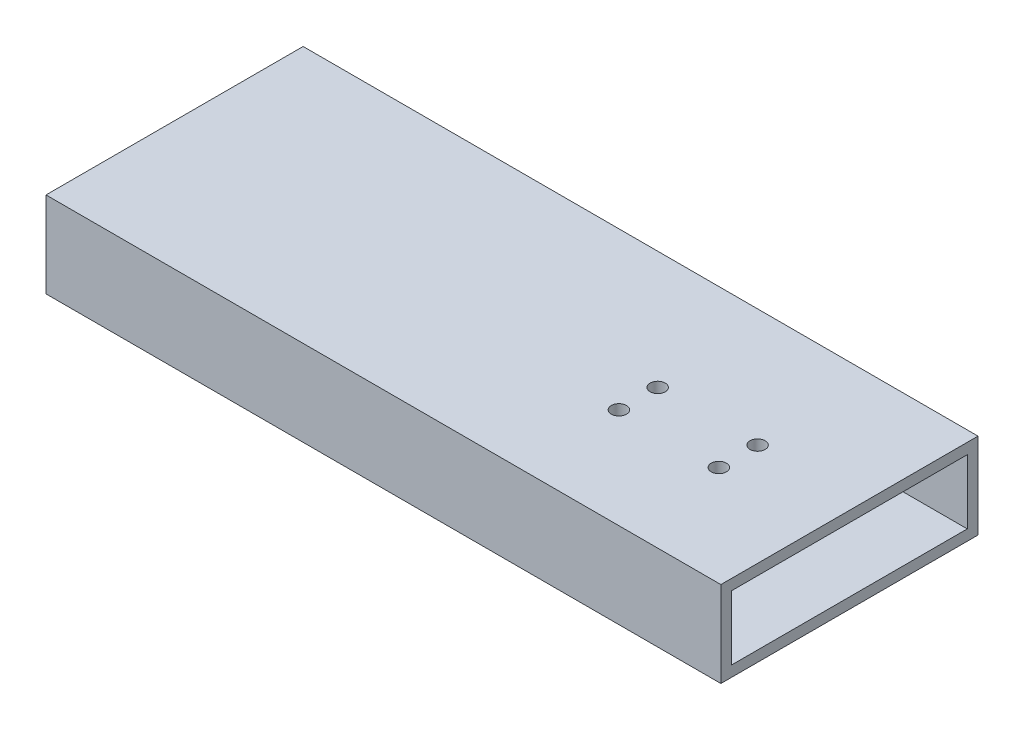
ISO-10303-21;
HEADER;
FILE_DESCRIPTION(('STEP AP214'),'2;1');
FILE_NAME('part.step','',(''),(''),'','','');
FILE_SCHEMA(('AUTOMOTIVE_DESIGN { 1 0 10303 214 1 1 1 1 }'));
ENDSEC;
DATA;
#1=APPLICATION_CONTEXT('core data for automotive mechanical design processes');
#2=APPLICATION_PROTOCOL_DEFINITION('international standard','automotive_design',2000,#1);
#3=PRODUCT_CONTEXT('',#1,'mechanical');
#4=PRODUCT('Part','Part','',(#3));
#5=PRODUCT_RELATED_PRODUCT_CATEGORY('part','',(#4));
#6=PRODUCT_DEFINITION_FORMATION('','',#4);
#7=PRODUCT_DEFINITION_CONTEXT('part definition',#1,'design');
#8=PRODUCT_DEFINITION('design','',#6,#7);
#9=PRODUCT_DEFINITION_SHAPE('','',#8);
#10=(LENGTH_UNIT() NAMED_UNIT(*) SI_UNIT(.MILLI.,.METRE.));
#11=(NAMED_UNIT(*) PLANE_ANGLE_UNIT() SI_UNIT($,.RADIAN.));
#12=(NAMED_UNIT(*) SI_UNIT($,.STERADIAN.) SOLID_ANGLE_UNIT());
#13=UNCERTAINTY_MEASURE_WITH_UNIT(LENGTH_MEASURE(1.E-05),#10,'distance_accuracy_value','');
#14=(GEOMETRIC_REPRESENTATION_CONTEXT(3) GLOBAL_UNCERTAINTY_ASSIGNED_CONTEXT((#13)) GLOBAL_UNIT_ASSIGNED_CONTEXT((#10,
#11,#12)) REPRESENTATION_CONTEXT('',''));
#15=CARTESIAN_POINT('',(0.,0.,0.));
#16=DIRECTION('',(0.,0.,1.));
#17=DIRECTION('',(1.,0.,0.));
#18=AXIS2_PLACEMENT_3D('',#15,#16,#17);
#19=CARTESIAN_POINT('',(400.,0.,0.));
#20=DIRECTION('',(-1.,0.,0.));
#21=DIRECTION('',(0.,0.,1.));
#22=AXIS2_PLACEMENT_3D('',#19,#20,#21);
#23=PLANE('',#22);
#24=DIRECTION('',(0.,1.,0.));
#25=VECTOR('',#24,1.);
#26=CARTESIAN_POINT('',(400.,-25.4,-76.2));
#27=LINE('',#26,#25);
#28=CARTESIAN_POINT('',(400.,-25.4,-76.2));
#29=VERTEX_POINT('',#28);
#30=CARTESIAN_POINT('',(400.,25.4,-76.2));
#31=VERTEX_POINT('',#30);
#32=EDGE_CURVE('E138',#29,#31,#27,.T.);
#33=ORIENTED_EDGE('',*,*,#32,.T.);
#34=DIRECTION('',(0.,0.,1.));
#35=VECTOR('',#34,1.);
#36=CARTESIAN_POINT('',(400.,25.4,76.2));
#37=LINE('',#36,#35);
#38=CARTESIAN_POINT('',(400.,25.4,76.2));
#39=VERTEX_POINT('',#38);
#40=EDGE_CURVE('E141',#31,#39,#37,.T.);
#41=ORIENTED_EDGE('',*,*,#40,.T.);
#42=DIRECTION('',(0.,-1.,0.));
#43=VECTOR('',#42,1.);
#44=CARTESIAN_POINT('',(400.,-25.4,76.2));
#45=LINE('',#44,#43);
#46=CARTESIAN_POINT('',(400.,-25.4,76.2));
#47=VERTEX_POINT('',#46);
#48=EDGE_CURVE('E144',#39,#47,#45,.T.);
#49=ORIENTED_EDGE('',*,*,#48,.T.);
#50=DIRECTION('',(0.,0.,-1.));
#51=VECTOR('',#50,1.);
#52=CARTESIAN_POINT('',(400.,-25.4,76.2));
#53=LINE('',#52,#51);
#54=EDGE_CURVE('E146',#47,#29,#53,.T.);
#55=ORIENTED_EDGE('',*,*,#54,.T.);
#56=EDGE_LOOP('',(#33,#41,#49,#55));
#57=FACE_BOUND('',#56,.T.);
#58=DIRECTION('',(0.,1.,0.));
#59=VECTOR('',#58,1.);
#60=CARTESIAN_POINT('',(400.,-19.05,-69.85));
#61=LINE('',#60,#59);
#62=CARTESIAN_POINT('',(400.,-19.05,-69.85));
#63=VERTEX_POINT('',#62);
#64=CARTESIAN_POINT('',(400.,19.05,-69.85));
#65=VERTEX_POINT('',#64);
#66=EDGE_CURVE('E100',#63,#65,#61,.T.);
#67=ORIENTED_EDGE('',*,*,#66,.F.);
#68=DIRECTION('',(0.,0.,-1.));
#69=VECTOR('',#68,1.);
#70=CARTESIAN_POINT('',(400.,-19.05,69.85));
#71=LINE('',#70,#69);
#72=CARTESIAN_POINT('',(400.,-19.05,69.85));
#73=VERTEX_POINT('',#72);
#74=EDGE_CURVE('E122',#73,#63,#71,.T.);
#75=ORIENTED_EDGE('',*,*,#74,.F.);
#76=DIRECTION('',(0.,-1.,0.));
#77=VECTOR('',#76,1.);
#78=CARTESIAN_POINT('',(400.,-19.05,69.85));
#79=LINE('',#78,#77);
#80=CARTESIAN_POINT('',(400.,19.05,69.85));
#81=VERTEX_POINT('',#80);
#82=EDGE_CURVE('E120',#81,#73,#79,.T.);
#83=ORIENTED_EDGE('',*,*,#82,.F.);
#84=DIRECTION('',(0.,0.,1.));
#85=VECTOR('',#84,1.);
#86=CARTESIAN_POINT('',(400.,19.05,69.85));
#87=LINE('',#86,#85);
#88=EDGE_CURVE('E108',#65,#81,#87,.T.);
#89=ORIENTED_EDGE('',*,*,#88,.F.);
#90=EDGE_LOOP('',(#67,#75,#83,#89));
#91=FACE_BOUND('',#90,.T.);
#92=ADVANCED_FACE('F33',(#57,#91),#23,.F.);
#93=CARTESIAN_POINT('',(0.,0.,0.));
#94=DIRECTION('',(-1.,0.,0.));
#95=DIRECTION('',(0.,0.,1.));
#96=AXIS2_PLACEMENT_3D('',#93,#94,#95);
#97=PLANE('',#96);
#98=DIRECTION('',(0.,1.,0.));
#99=VECTOR('',#98,1.);
#100=CARTESIAN_POINT('',(0.,-25.4,-76.2));
#101=LINE('',#100,#99);
#102=CARTESIAN_POINT('',(0.,-25.4,-76.2));
#103=VERTEX_POINT('',#102);
#104=CARTESIAN_POINT('',(0.,25.4,-76.2));
#105=VERTEX_POINT('',#104);
#106=EDGE_CURVE('E116',#103,#105,#101,.T.);
#107=ORIENTED_EDGE('',*,*,#106,.F.);
#108=DIRECTION('',(0.,0.,-1.));
#109=VECTOR('',#108,1.);
#110=CARTESIAN_POINT('',(0.,-25.4,76.2));
#111=LINE('',#110,#109);
#112=CARTESIAN_POINT('',(0.,-25.4,76.2));
#113=VERTEX_POINT('',#112);
#114=EDGE_CURVE('E142',#113,#103,#111,.T.);
#115=ORIENTED_EDGE('',*,*,#114,.F.);
#116=DIRECTION('',(0.,-1.,0.));
#117=VECTOR('',#116,1.);
#118=CARTESIAN_POINT('',(0.,-25.4,76.2));
#119=LINE('',#118,#117);
#120=CARTESIAN_POINT('',(0.,25.4,76.2));
#121=VERTEX_POINT('',#120);
#122=EDGE_CURVE('E153',#121,#113,#119,.T.);
#123=ORIENTED_EDGE('',*,*,#122,.F.);
#124=DIRECTION('',(0.,0.,1.));
#125=VECTOR('',#124,1.);
#126=CARTESIAN_POINT('',(0.,25.4,76.2));
#127=LINE('',#126,#125);
#128=EDGE_CURVE('E151',#105,#121,#127,.T.);
#129=ORIENTED_EDGE('',*,*,#128,.F.);
#130=EDGE_LOOP('',(#107,#115,#123,#129));
#131=FACE_BOUND('',#130,.T.);
#132=DIRECTION('',(0.,0.,-1.));
#133=VECTOR('',#132,1.);
#134=CARTESIAN_POINT('',(0.,-19.05,69.85));
#135=LINE('',#134,#133);
#136=CARTESIAN_POINT('',(0.,-19.05,69.85));
#137=VERTEX_POINT('',#136);
#138=CARTESIAN_POINT('',(0.,-19.05,-69.85));
#139=VERTEX_POINT('',#138);
#140=EDGE_CURVE('E109',#137,#139,#135,.T.);
#141=ORIENTED_EDGE('',*,*,#140,.T.);
#142=DIRECTION('',(0.,1.,0.));
#143=VECTOR('',#142,1.);
#144=CARTESIAN_POINT('',(0.,-19.05,-69.85));
#145=LINE('',#144,#143);
#146=CARTESIAN_POINT('',(0.,19.05,-69.85));
#147=VERTEX_POINT('',#146);
#148=EDGE_CURVE('E58',#139,#147,#145,.T.);
#149=ORIENTED_EDGE('',*,*,#148,.T.);
#150=DIRECTION('',(0.,0.,1.));
#151=VECTOR('',#150,1.);
#152=CARTESIAN_POINT('',(0.,19.05,69.85));
#153=LINE('',#152,#151);
#154=CARTESIAN_POINT('',(0.,19.05,69.85));
#155=VERTEX_POINT('',#154);
#156=EDGE_CURVE('E115',#147,#155,#153,.T.);
#157=ORIENTED_EDGE('',*,*,#156,.T.);
#158=DIRECTION('',(0.,-1.,0.));
#159=VECTOR('',#158,1.);
#160=CARTESIAN_POINT('',(0.,-19.05,69.85));
#161=LINE('',#160,#159);
#162=EDGE_CURVE('E130',#155,#137,#161,.T.);
#163=ORIENTED_EDGE('',*,*,#162,.T.);
#164=EDGE_LOOP('',(#141,#149,#157,#163));
#165=FACE_BOUND('',#164,.T.);
#166=ADVANCED_FACE('F222',(#131,#165),#97,.T.);
#167=CARTESIAN_POINT('',(400.,-25.4,-76.2));
#168=DIRECTION('',(0.,0.,1.));
#169=DIRECTION('',(1.,0.,0.));
#170=AXIS2_PLACEMENT_3D('',#167,#168,#169);
#171=PLANE('',#170);
#172=ORIENTED_EDGE('',*,*,#106,.T.);
#173=DIRECTION('',(-1.,0.,0.));
#174=VECTOR('',#173,1.);
#175=CARTESIAN_POINT('',(400.,25.4,-76.2));
#176=LINE('',#175,#174);
#177=EDGE_CURVE('E11',#31,#105,#176,.T.);
#178=ORIENTED_EDGE('',*,*,#177,.F.);
#179=ORIENTED_EDGE('',*,*,#32,.F.);
#180=DIRECTION('',(-1.,0.,0.));
#181=VECTOR('',#180,1.);
#182=CARTESIAN_POINT('',(400.,-25.4,-76.2));
#183=LINE('',#182,#181);
#184=EDGE_CURVE('E148',#29,#103,#183,.T.);
#185=ORIENTED_EDGE('',*,*,#184,.T.);
#186=EDGE_LOOP('',(#172,#178,#179,#185));
#187=FACE_BOUND('',#186,.T.);
#188=ADVANCED_FACE('F35',(#187),#171,.F.);
#189=CARTESIAN_POINT('',(400.,25.4,76.2));
#190=DIRECTION('',(0.,-1.,0.));
#191=DIRECTION('',(0.,0.,-1.));
#192=AXIS2_PLACEMENT_3D('',#189,#190,#191);
#193=PLANE('',#192);
#194=CARTESIAN_POINT('',(280.090000000005,25.4,16.7300000000007));
#195=DIRECTION('',(0.,-1.,0.));
#196=DIRECTION('',(0.,0.,-1.));
#197=AXIS2_PLACEMENT_3D('',#194,#195,#196);
#198=CIRCLE('',#197,4.5);
#199=CARTESIAN_POINT('',(280.090000000005,25.4,12.2300000000007));
#200=VERTEX_POINT('',#199);
#201=EDGE_CURVE('E246',#200,#200,#198,.T.);
#202=ORIENTED_EDGE('',*,*,#201,.T.);
#203=EDGE_LOOP('',(#202));
#204=FACE_BOUND('',#203,.T.);
#205=CARTESIAN_POINT('',(280.090000000005,25.4,-6.26999999999863));
#206=DIRECTION('',(0.,-1.,0.));
#207=DIRECTION('',(0.,0.,-1.));
#208=AXIS2_PLACEMENT_3D('',#205,#206,#207);
#209=CIRCLE('',#208,4.5);
#210=CARTESIAN_POINT('',(280.090000000005,25.4,-10.7699999999986));
#211=VERTEX_POINT('',#210);
#212=EDGE_CURVE('E174',#211,#211,#209,.T.);
#213=ORIENTED_EDGE('',*,*,#212,.T.);
#214=EDGE_LOOP('',(#213));
#215=FACE_BOUND('',#214,.T.);
#216=CARTESIAN_POINT('',(339.289999999982,25.4,-6.26999999999863));
#217=DIRECTION('',(0.,-1.,0.));
#218=DIRECTION('',(0.,0.,-1.));
#219=AXIS2_PLACEMENT_3D('',#216,#217,#218);
#220=CIRCLE('',#219,4.5);
#221=CARTESIAN_POINT('',(339.289999999982,25.4,-10.7699999999986));
#222=VERTEX_POINT('',#221);
#223=EDGE_CURVE('E170',#222,#222,#220,.T.);
#224=ORIENTED_EDGE('',*,*,#223,.T.);
#225=EDGE_LOOP('',(#224));
#226=FACE_BOUND('',#225,.T.);
#227=CARTESIAN_POINT('',(339.289999999982,25.4,16.7300000000007));
#228=DIRECTION('',(0.,-1.,0.));
#229=DIRECTION('',(0.,0.,-1.));
#230=AXIS2_PLACEMENT_3D('',#227,#228,#229);
#231=CIRCLE('',#230,4.5);
#232=CARTESIAN_POINT('',(339.289999999982,25.4,12.2300000000007));
#233=VERTEX_POINT('',#232);
#234=EDGE_CURVE('E166',#233,#233,#231,.T.);
#235=ORIENTED_EDGE('',*,*,#234,.T.);
#236=EDGE_LOOP('',(#235));
#237=FACE_BOUND('',#236,.T.);
#238=ORIENTED_EDGE('',*,*,#128,.T.);
#239=DIRECTION('',(-1.,0.,0.));
#240=VECTOR('',#239,1.);
#241=CARTESIAN_POINT('',(400.,25.4,76.2));
#242=LINE('',#241,#240);
#243=EDGE_CURVE('E42',#39,#121,#242,.T.);
#244=ORIENTED_EDGE('',*,*,#243,.F.);
#245=ORIENTED_EDGE('',*,*,#40,.F.);
#246=ORIENTED_EDGE('',*,*,#177,.T.);
#247=EDGE_LOOP('',(#238,#244,#245,#246));
#248=FACE_BOUND('',#247,.T.);
#249=ADVANCED_FACE('F236',(#204,#215,#226,#237,#248),#193,.F.);
#250=CARTESIAN_POINT('',(400.,-25.4,76.2));
#251=DIRECTION('',(0.,0.,-1.));
#252=DIRECTION('',(-1.,0.,0.));
#253=AXIS2_PLACEMENT_3D('',#250,#251,#252);
#254=PLANE('',#253);
#255=ORIENTED_EDGE('',*,*,#122,.T.);
#256=DIRECTION('',(-1.,0.,0.));
#257=VECTOR('',#256,1.);
#258=CARTESIAN_POINT('',(400.,-25.4,76.2));
#259=LINE('',#258,#257);
#260=EDGE_CURVE('E158',#47,#113,#259,.T.);
#261=ORIENTED_EDGE('',*,*,#260,.F.);
#262=ORIENTED_EDGE('',*,*,#48,.F.);
#263=ORIENTED_EDGE('',*,*,#243,.T.);
#264=EDGE_LOOP('',(#255,#261,#262,#263));
#265=FACE_BOUND('',#264,.T.);
#266=ADVANCED_FACE('F233',(#265),#254,.F.);
#267=CARTESIAN_POINT('',(400.,-25.4,76.2));
#268=DIRECTION('',(0.,1.,0.));
#269=DIRECTION('',(0.,0.,1.));
#270=AXIS2_PLACEMENT_3D('',#267,#268,#269);
#271=PLANE('',#270);
#272=CARTESIAN_POINT('',(280.090000000005,-25.4,16.7300000000007));
#273=DIRECTION('',(0.,-1.,0.));
#274=DIRECTION('',(0.,0.,-1.));
#275=AXIS2_PLACEMENT_3D('',#272,#273,#274);
#276=CIRCLE('',#275,4.5);
#277=CARTESIAN_POINT('',(280.090000000005,-25.4,12.2300000000007));
#278=VERTEX_POINT('',#277);
#279=EDGE_CURVE('E300',#278,#278,#276,.T.);
#280=ORIENTED_EDGE('',*,*,#279,.F.);
#281=EDGE_LOOP('',(#280));
#282=FACE_BOUND('',#281,.T.);
#283=CARTESIAN_POINT('',(280.090000000005,-25.4,-6.26999999999863));
#284=DIRECTION('',(0.,-1.,0.));
#285=DIRECTION('',(0.,0.,-1.));
#286=AXIS2_PLACEMENT_3D('',#283,#284,#285);
#287=CIRCLE('',#286,4.5);
#288=CARTESIAN_POINT('',(280.090000000005,-25.4,-10.7699999999986));
#289=VERTEX_POINT('',#288);
#290=EDGE_CURVE('E181',#289,#289,#287,.T.);
#291=ORIENTED_EDGE('',*,*,#290,.F.);
#292=EDGE_LOOP('',(#291));
#293=FACE_BOUND('',#292,.T.);
#294=CARTESIAN_POINT('',(339.289999999982,-25.4,-6.26999999999863));
#295=DIRECTION('',(0.,-1.,0.));
#296=DIRECTION('',(0.,0.,-1.));
#297=AXIS2_PLACEMENT_3D('',#294,#295,#296);
#298=CIRCLE('',#297,4.5);
#299=CARTESIAN_POINT('',(339.289999999982,-25.4,-10.7699999999986));
#300=VERTEX_POINT('',#299);
#301=EDGE_CURVE('E178',#300,#300,#298,.T.);
#302=ORIENTED_EDGE('',*,*,#301,.F.);
#303=EDGE_LOOP('',(#302));
#304=FACE_BOUND('',#303,.T.);
#305=CARTESIAN_POINT('',(339.289999999982,-25.4,16.7300000000007));
#306=DIRECTION('',(0.,-1.,0.));
#307=DIRECTION('',(0.,0.,-1.));
#308=AXIS2_PLACEMENT_3D('',#305,#306,#307);
#309=CIRCLE('',#308,4.5);
#310=CARTESIAN_POINT('',(339.289999999982,-25.4,12.2300000000007));
#311=VERTEX_POINT('',#310);
#312=EDGE_CURVE('E196',#311,#311,#309,.T.);
#313=ORIENTED_EDGE('',*,*,#312,.F.);
#314=EDGE_LOOP('',(#313));
#315=FACE_BOUND('',#314,.T.);
#316=ORIENTED_EDGE('',*,*,#114,.T.);
#317=ORIENTED_EDGE('',*,*,#184,.F.);
#318=ORIENTED_EDGE('',*,*,#54,.F.);
#319=ORIENTED_EDGE('',*,*,#260,.T.);
#320=EDGE_LOOP('',(#316,#317,#318,#319));
#321=FACE_BOUND('',#320,.T.);
#322=ADVANCED_FACE('F217',(#282,#293,#304,#315,#321),#271,.F.);
#323=CARTESIAN_POINT('',(400.,-19.05,-69.85));
#324=DIRECTION('',(0.,0.,1.));
#325=DIRECTION('',(1.,0.,0.));
#326=AXIS2_PLACEMENT_3D('',#323,#324,#325);
#327=PLANE('',#326);
#328=ORIENTED_EDGE('',*,*,#148,.F.);
#329=DIRECTION('',(-1.,0.,0.));
#330=VECTOR('',#329,1.);
#331=CARTESIAN_POINT('',(400.,-19.05,-69.85));
#332=LINE('',#331,#330);
#333=EDGE_CURVE('E104',#63,#139,#332,.T.);
#334=ORIENTED_EDGE('',*,*,#333,.F.);
#335=ORIENTED_EDGE('',*,*,#66,.T.);
#336=DIRECTION('',(-1.,0.,0.));
#337=VECTOR('',#336,1.);
#338=CARTESIAN_POINT('',(400.,19.05,-69.85));
#339=LINE('',#338,#337);
#340=EDGE_CURVE('E103',#65,#147,#339,.T.);
#341=ORIENTED_EDGE('',*,*,#340,.T.);
#342=EDGE_LOOP('',(#328,#334,#335,#341));
#343=FACE_BOUND('',#342,.T.);
#344=ADVANCED_FACE('F102',(#343),#327,.T.);
#345=CARTESIAN_POINT('',(400.,19.05,69.85));
#346=DIRECTION('',(0.,-1.,0.));
#347=DIRECTION('',(0.,0.,-1.));
#348=AXIS2_PLACEMENT_3D('',#345,#346,#347);
#349=PLANE('',#348);
#350=CARTESIAN_POINT('',(280.090000000005,19.05,16.7300000000007));
#351=DIRECTION('',(0.,-1.,0.));
#352=DIRECTION('',(0.,0.,-1.));
#353=AXIS2_PLACEMENT_3D('',#350,#351,#352);
#354=CIRCLE('',#353,4.5);
#355=CARTESIAN_POINT('',(280.090000000005,19.05,12.2300000000007));
#356=VERTEX_POINT('',#355);
#357=EDGE_CURVE('E186',#356,#356,#354,.T.);
#358=ORIENTED_EDGE('',*,*,#357,.F.);
#359=EDGE_LOOP('',(#358));
#360=FACE_BOUND('',#359,.T.);
#361=CARTESIAN_POINT('',(280.090000000005,19.05,-6.26999999999863));
#362=DIRECTION('',(0.,-1.,0.));
#363=DIRECTION('',(0.,0.,-1.));
#364=AXIS2_PLACEMENT_3D('',#361,#362,#363);
#365=CIRCLE('',#364,4.5);
#366=CARTESIAN_POINT('',(280.090000000005,19.05,-10.7699999999986));
#367=VERTEX_POINT('',#366);
#368=EDGE_CURVE('E173',#367,#367,#365,.T.);
#369=ORIENTED_EDGE('',*,*,#368,.F.);
#370=EDGE_LOOP('',(#369));
#371=FACE_BOUND('',#370,.T.);
#372=CARTESIAN_POINT('',(339.289999999982,19.05,-6.26999999999863));
#373=DIRECTION('',(0.,-1.,0.));
#374=DIRECTION('',(0.,0.,-1.));
#375=AXIS2_PLACEMENT_3D('',#372,#373,#374);
#376=CIRCLE('',#375,4.5);
#377=CARTESIAN_POINT('',(339.289999999982,19.05,-10.7699999999986));
#378=VERTEX_POINT('',#377);
#379=EDGE_CURVE('E169',#378,#378,#376,.T.);
#380=ORIENTED_EDGE('',*,*,#379,.F.);
#381=EDGE_LOOP('',(#380));
#382=FACE_BOUND('',#381,.T.);
#383=CARTESIAN_POINT('',(339.289999999982,19.05,16.7300000000007));
#384=DIRECTION('',(0.,-1.,0.));
#385=DIRECTION('',(0.,0.,-1.));
#386=AXIS2_PLACEMENT_3D('',#383,#384,#385);
#387=CIRCLE('',#386,4.5);
#388=CARTESIAN_POINT('',(339.289999999982,19.05,12.2300000000007));
#389=VERTEX_POINT('',#388);
#390=EDGE_CURVE('E128',#389,#389,#387,.T.);
#391=ORIENTED_EDGE('',*,*,#390,.F.);
#392=EDGE_LOOP('',(#391));
#393=FACE_BOUND('',#392,.T.);
#394=ORIENTED_EDGE('',*,*,#156,.F.);
#395=ORIENTED_EDGE('',*,*,#340,.F.);
#396=ORIENTED_EDGE('',*,*,#88,.T.);
#397=DIRECTION('',(-1.,0.,0.));
#398=VECTOR('',#397,1.);
#399=CARTESIAN_POINT('',(400.,19.05,69.85));
#400=LINE('',#399,#398);
#401=EDGE_CURVE('E117',#81,#155,#400,.T.);
#402=ORIENTED_EDGE('',*,*,#401,.T.);
#403=EDGE_LOOP('',(#394,#395,#396,#402));
#404=FACE_BOUND('',#403,.T.);
#405=ADVANCED_FACE('F112',(#360,#371,#382,#393,#404),#349,.T.);
#406=CARTESIAN_POINT('',(400.,-19.05,69.85));
#407=DIRECTION('',(0.,0.,-1.));
#408=DIRECTION('',(-1.,0.,0.));
#409=AXIS2_PLACEMENT_3D('',#406,#407,#408);
#410=PLANE('',#409);
#411=ORIENTED_EDGE('',*,*,#162,.F.);
#412=ORIENTED_EDGE('',*,*,#401,.F.);
#413=ORIENTED_EDGE('',*,*,#82,.T.);
#414=DIRECTION('',(-1.,0.,0.));
#415=VECTOR('',#414,1.);
#416=CARTESIAN_POINT('',(400.,-19.05,69.85));
#417=LINE('',#416,#415);
#418=EDGE_CURVE('E50',#73,#137,#417,.T.);
#419=ORIENTED_EDGE('',*,*,#418,.T.);
#420=EDGE_LOOP('',(#411,#412,#413,#419));
#421=FACE_BOUND('',#420,.T.);
#422=ADVANCED_FACE('F207',(#421),#410,.T.);
#423=CARTESIAN_POINT('',(400.,-19.05,69.85));
#424=DIRECTION('',(0.,1.,0.));
#425=DIRECTION('',(0.,0.,1.));
#426=AXIS2_PLACEMENT_3D('',#423,#424,#425);
#427=PLANE('',#426);
#428=CARTESIAN_POINT('',(280.090000000005,-19.05,16.7300000000007));
#429=DIRECTION('',(0.,1.,0.));
#430=DIRECTION('',(0.,0.,1.));
#431=AXIS2_PLACEMENT_3D('',#428,#429,#430);
#432=CIRCLE('',#431,4.5);
#433=CARTESIAN_POINT('',(280.090000000005,-19.05,21.2300000000007));
#434=VERTEX_POINT('',#433);
#435=EDGE_CURVE('E37',#434,#434,#432,.T.);
#436=ORIENTED_EDGE('',*,*,#435,.F.);
#437=EDGE_LOOP('',(#436));
#438=FACE_BOUND('',#437,.T.);
#439=CARTESIAN_POINT('',(280.090000000005,-19.05,-6.26999999999863));
#440=DIRECTION('',(0.,1.,0.));
#441=DIRECTION('',(0.,0.,1.));
#442=AXIS2_PLACEMENT_3D('',#439,#440,#441);
#443=CIRCLE('',#442,4.5);
#444=CARTESIAN_POINT('',(280.090000000005,-19.05,-1.76999999999862));
#445=VERTEX_POINT('',#444);
#446=EDGE_CURVE('E171',#445,#445,#443,.T.);
#447=ORIENTED_EDGE('',*,*,#446,.F.);
#448=EDGE_LOOP('',(#447));
#449=FACE_BOUND('',#448,.T.);
#450=CARTESIAN_POINT('',(339.289999999982,-19.05,-6.26999999999863));
#451=DIRECTION('',(0.,1.,0.));
#452=DIRECTION('',(0.,0.,1.));
#453=AXIS2_PLACEMENT_3D('',#450,#451,#452);
#454=CIRCLE('',#453,4.5);
#455=CARTESIAN_POINT('',(339.289999999982,-19.05,-1.76999999999862));
#456=VERTEX_POINT('',#455);
#457=EDGE_CURVE('E167',#456,#456,#454,.T.);
#458=ORIENTED_EDGE('',*,*,#457,.F.);
#459=EDGE_LOOP('',(#458));
#460=FACE_BOUND('',#459,.T.);
#461=CARTESIAN_POINT('',(339.289999999982,-19.05,16.7300000000007));
#462=DIRECTION('',(0.,1.,0.));
#463=DIRECTION('',(0.,0.,1.));
#464=AXIS2_PLACEMENT_3D('',#461,#462,#463);
#465=CIRCLE('',#464,4.5);
#466=CARTESIAN_POINT('',(339.289999999982,-19.05,21.2300000000007));
#467=VERTEX_POINT('',#466);
#468=EDGE_CURVE('E163',#467,#467,#465,.T.);
#469=ORIENTED_EDGE('',*,*,#468,.F.);
#470=EDGE_LOOP('',(#469));
#471=FACE_BOUND('',#470,.T.);
#472=ORIENTED_EDGE('',*,*,#140,.F.);
#473=ORIENTED_EDGE('',*,*,#418,.F.);
#474=ORIENTED_EDGE('',*,*,#74,.T.);
#475=ORIENTED_EDGE('',*,*,#333,.T.);
#476=EDGE_LOOP('',(#472,#473,#474,#475));
#477=FACE_BOUND('',#476,.T.);
#478=ADVANCED_FACE('F214',(#438,#449,#460,#471,#477),#427,.T.);
#479=CARTESIAN_POINT('',(339.289999999982,-25.4,16.7300000000007));
#480=DIRECTION('',(0.,-1.,0.));
#481=DIRECTION('',(0.,0.,-1.));
#482=AXIS2_PLACEMENT_3D('',#479,#480,#481);
#483=CYLINDRICAL_SURFACE('',#482,4.5);
#484=ORIENTED_EDGE('',*,*,#468,.T.);
#485=EDGE_LOOP('',(#484));
#486=FACE_BOUND('',#485,.T.);
#487=ORIENTED_EDGE('',*,*,#312,.T.);
#488=EDGE_LOOP('',(#487));
#489=FACE_BOUND('',#488,.T.);
#490=ADVANCED_FACE('F266',(#486,#489),#483,.F.);
#491=ORIENTED_EDGE('',*,*,#390,.T.);
#492=EDGE_LOOP('',(#491));
#493=FACE_BOUND('',#492,.T.);
#494=ORIENTED_EDGE('',*,*,#234,.F.);
#495=EDGE_LOOP('',(#494));
#496=FACE_BOUND('',#495,.T.);
#497=ADVANCED_FACE('F203',(#493,#496),#483,.F.);
#498=CARTESIAN_POINT('',(339.289999999982,-25.4,-6.26999999999863));
#499=DIRECTION('',(0.,-1.,0.));
#500=DIRECTION('',(0.,0.,-1.));
#501=AXIS2_PLACEMENT_3D('',#498,#499,#500);
#502=CYLINDRICAL_SURFACE('',#501,4.5);
#503=ORIENTED_EDGE('',*,*,#457,.T.);
#504=EDGE_LOOP('',(#503));
#505=FACE_BOUND('',#504,.T.);
#506=ORIENTED_EDGE('',*,*,#301,.T.);
#507=EDGE_LOOP('',(#506));
#508=FACE_BOUND('',#507,.T.);
#509=ADVANCED_FACE('F277',(#505,#508),#502,.F.);
#510=ORIENTED_EDGE('',*,*,#379,.T.);
#511=EDGE_LOOP('',(#510));
#512=FACE_BOUND('',#511,.T.);
#513=ORIENTED_EDGE('',*,*,#223,.F.);
#514=EDGE_LOOP('',(#513));
#515=FACE_BOUND('',#514,.T.);
#516=ADVANCED_FACE('F280',(#512,#515),#502,.F.);
#517=CARTESIAN_POINT('',(280.090000000005,-25.4,-6.26999999999863));
#518=DIRECTION('',(0.,-1.,0.));
#519=DIRECTION('',(0.,0.,-1.));
#520=AXIS2_PLACEMENT_3D('',#517,#518,#519);
#521=CYLINDRICAL_SURFACE('',#520,4.5);
#522=ORIENTED_EDGE('',*,*,#446,.T.);
#523=EDGE_LOOP('',(#522));
#524=FACE_BOUND('',#523,.T.);
#525=ORIENTED_EDGE('',*,*,#290,.T.);
#526=EDGE_LOOP('',(#525));
#527=FACE_BOUND('',#526,.T.);
#528=ADVANCED_FACE('F282',(#524,#527),#521,.F.);
#529=ORIENTED_EDGE('',*,*,#368,.T.);
#530=EDGE_LOOP('',(#529));
#531=FACE_BOUND('',#530,.T.);
#532=ORIENTED_EDGE('',*,*,#212,.F.);
#533=EDGE_LOOP('',(#532));
#534=FACE_BOUND('',#533,.T.);
#535=ADVANCED_FACE('F285',(#531,#534),#521,.F.);
#536=CARTESIAN_POINT('',(280.090000000005,-25.4,16.7300000000007));
#537=DIRECTION('',(0.,-1.,0.));
#538=DIRECTION('',(0.,0.,-1.));
#539=AXIS2_PLACEMENT_3D('',#536,#537,#538);
#540=CYLINDRICAL_SURFACE('',#539,4.5);
#541=ORIENTED_EDGE('',*,*,#435,.T.);
#542=EDGE_LOOP('',(#541));
#543=FACE_BOUND('',#542,.T.);
#544=ORIENTED_EDGE('',*,*,#279,.T.);
#545=EDGE_LOOP('',(#544));
#546=FACE_BOUND('',#545,.T.);
#547=ADVANCED_FACE('F286',(#543,#546),#540,.F.);
#548=ORIENTED_EDGE('',*,*,#357,.T.);
#549=EDGE_LOOP('',(#548));
#550=FACE_BOUND('',#549,.T.);
#551=ORIENTED_EDGE('',*,*,#201,.F.);
#552=EDGE_LOOP('',(#551));
#553=FACE_BOUND('',#552,.T.);
#554=ADVANCED_FACE('F288',(#550,#553),#540,.F.);
#555=CLOSED_SHELL('',(#92,#166,#188,#249,#266,#322,#344,#405,#422,#478,#490,#497,#509,#516,#528,
#535,#547,#554));
#556=MANIFOLD_SOLID_BREP('B2',#555);
#557=ADVANCED_BREP_SHAPE_REPRESENTATION('',(#18,#556),#14);
#558=SHAPE_DEFINITION_REPRESENTATION(#9,#557);
ENDSEC;
END-ISO-10303-21;
